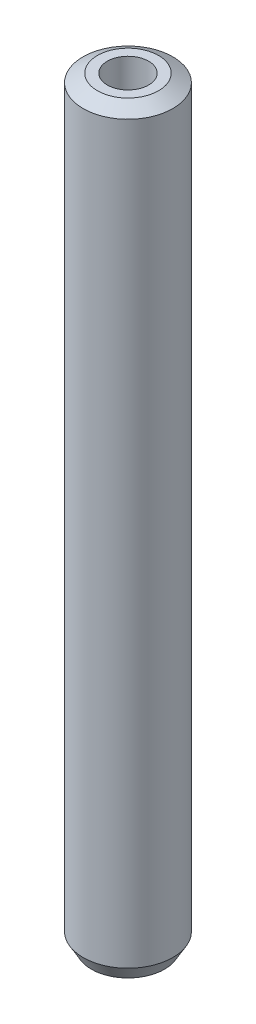
ISO-10303-21;
HEADER;
FILE_DESCRIPTION(('STEP AP214'),'2;1');
FILE_NAME('part.step','',(''),(''),'','','');
FILE_SCHEMA(('AUTOMOTIVE_DESIGN { 1 0 10303 214 1 1 1 1 }'));
ENDSEC;
DATA;
#1=APPLICATION_CONTEXT('core data for automotive mechanical design processes');
#2=APPLICATION_PROTOCOL_DEFINITION('international standard','automotive_design',2000,#1);
#3=PRODUCT_CONTEXT('',#1,'mechanical');
#4=PRODUCT('Part','Part','',(#3));
#5=PRODUCT_RELATED_PRODUCT_CATEGORY('part','',(#4));
#6=PRODUCT_DEFINITION_FORMATION('','',#4);
#7=PRODUCT_DEFINITION_CONTEXT('part definition',#1,'design');
#8=PRODUCT_DEFINITION('design','',#6,#7);
#9=PRODUCT_DEFINITION_SHAPE('','',#8);
#10=(LENGTH_UNIT() NAMED_UNIT(*) SI_UNIT(.MILLI.,.METRE.));
#11=(NAMED_UNIT(*) PLANE_ANGLE_UNIT() SI_UNIT($,.RADIAN.));
#12=(NAMED_UNIT(*) SI_UNIT($,.STERADIAN.) SOLID_ANGLE_UNIT());
#13=UNCERTAINTY_MEASURE_WITH_UNIT(LENGTH_MEASURE(1.E-05),#10,'distance_accuracy_value','');
#14=(GEOMETRIC_REPRESENTATION_CONTEXT(3) GLOBAL_UNCERTAINTY_ASSIGNED_CONTEXT((#13)) GLOBAL_UNIT_ASSIGNED_CONTEXT((#10,
#11,#12)) REPRESENTATION_CONTEXT('',''));
#15=CARTESIAN_POINT('',(0.,0.,0.));
#16=DIRECTION('',(0.,0.,1.));
#17=DIRECTION('',(1.,0.,0.));
#18=AXIS2_PLACEMENT_3D('',#15,#16,#17);
#19=CARTESIAN_POINT('',(0.,422.061469823359,0.));
#20=DIRECTION('',(0.,-1.,0.));
#21=DIRECTION('',(0.,0.,-1.));
#22=AXIS2_PLACEMENT_3D('',#19,#20,#21);
#23=CYLINDRICAL_SURFACE('',#22,25.);
#24=CARTESIAN_POINT('',(0.,417.462703302529,0.));
#25=DIRECTION('',(0.,1.,0.));
#26=DIRECTION('',(0.,0.,1.));
#27=AXIS2_PLACEMENT_3D('',#24,#25,#26);
#28=CIRCLE('',#27,25.);
#29=CARTESIAN_POINT('',(0.,417.462703302529,25.));
#30=VERTEX_POINT('',#29);
#31=EDGE_CURVE('E50',#30,#30,#28,.F.);
#32=ORIENTED_EDGE('',*,*,#31,.T.);
#33=EDGE_LOOP('',(#32));
#34=FACE_BOUND('',#33,.T.);
#35=CARTESIAN_POINT('',(0.,7.96529726622425,0.));
#36=DIRECTION('',(0.,1.,0.));
#37=DIRECTION('',(0.,0.,1.));
#38=AXIS2_PLACEMENT_3D('',#35,#36,#37);
#39=CIRCLE('',#38,25.);
#40=CARTESIAN_POINT('',(0.,7.96529726622425,25.));
#41=VERTEX_POINT('',#40);
#42=EDGE_CURVE('E51',#41,#41,#39,.T.);
#43=ORIENTED_EDGE('',*,*,#42,.T.);
#44=EDGE_LOOP('',(#43));
#45=FACE_BOUND('',#44,.T.);
#46=ADVANCED_FACE('F39',(#34,#45),#23,.T.);
#47=CARTESIAN_POINT('',(0.,422.061469823359,0.));
#48=DIRECTION('',(0.,1.,0.));
#49=DIRECTION('',(0.,0.,1.));
#50=AXIS2_PLACEMENT_3D('',#47,#48,#49);
#51=PLANE('',#50);
#52=CARTESIAN_POINT('',(0.,422.061469823359,0.));
#53=DIRECTION('',(0.,1.,0.));
#54=DIRECTION('',(0.,0.,1.));
#55=AXIS2_PLACEMENT_3D('',#52,#53,#54);
#56=CIRCLE('',#55,17.0347027337758);
#57=CARTESIAN_POINT('',(0.,422.061469823359,17.0347027337758));
#58=VERTEX_POINT('',#57);
#59=EDGE_CURVE('E54',#58,#58,#56,.T.);
#60=ORIENTED_EDGE('',*,*,#59,.T.);
#61=EDGE_LOOP('',(#60));
#62=FACE_BOUND('',#61,.T.);
#63=CARTESIAN_POINT('',(0.,422.061469823359,0.));
#64=DIRECTION('',(0.,1.,0.));
#65=DIRECTION('',(0.,0.,1.));
#66=AXIS2_PLACEMENT_3D('',#63,#64,#65);
#67=CIRCLE('',#66,11.5132658832677);
#68=CARTESIAN_POINT('',(0.,422.061469823359,11.5132658832677));
#69=VERTEX_POINT('',#68);
#70=EDGE_CURVE('E58',#69,#69,#67,.T.);
#71=ORIENTED_EDGE('',*,*,#70,.F.);
#72=EDGE_LOOP('',(#71));
#73=FACE_BOUND('',#72,.T.);
#74=ADVANCED_FACE('F69',(#62,#73),#51,.T.);
#75=CARTESIAN_POINT('',(0.,0.,0.));
#76=DIRECTION('',(0.,1.,0.));
#77=DIRECTION('',(0.,0.,1.));
#78=AXIS2_PLACEMENT_3D('',#75,#76,#77);
#79=PLANE('',#78);
#80=CARTESIAN_POINT('',(0.,0.,0.));
#81=DIRECTION('',(0.,1.,0.));
#82=DIRECTION('',(0.,0.,1.));
#83=AXIS2_PLACEMENT_3D('',#80,#81,#82);
#84=CIRCLE('',#83,20.40123347917);
#85=CARTESIAN_POINT('',(0.,0.,20.40123347917));
#86=VERTEX_POINT('',#85);
#87=EDGE_CURVE('E10',#86,#86,#84,.F.);
#88=ORIENTED_EDGE('',*,*,#87,.T.);
#89=EDGE_LOOP('',(#88));
#90=FACE_BOUND('',#89,.T.);
#91=CARTESIAN_POINT('',(0.,0.,0.));
#92=DIRECTION('',(0.,1.,0.));
#93=DIRECTION('',(0.,0.,1.));
#94=AXIS2_PLACEMENT_3D('',#91,#92,#93);
#95=CIRCLE('',#94,11.5132658832677);
#96=CARTESIAN_POINT('',(0.,0.,11.5132658832677));
#97=VERTEX_POINT('',#96);
#98=EDGE_CURVE('E63',#97,#97,#95,.T.);
#99=ORIENTED_EDGE('',*,*,#98,.T.);
#100=EDGE_LOOP('',(#99));
#101=FACE_BOUND('',#100,.T.);
#102=ADVANCED_FACE('F75',(#90,#101),#79,.F.);
#103=CARTESIAN_POINT('',(0.,422.061469823359,0.));
#104=DIRECTION('',(0.,-1.,0.));
#105=DIRECTION('',(0.,0.,-1.));
#106=AXIS2_PLACEMENT_3D('',#103,#104,#105);
#107=CYLINDRICAL_SURFACE('',#106,11.5132658832677);
#108=ORIENTED_EDGE('',*,*,#70,.T.);
#109=EDGE_LOOP('',(#108));
#110=FACE_BOUND('',#109,.T.);
#111=ORIENTED_EDGE('',*,*,#98,.F.);
#112=EDGE_LOOP('',(#111));
#113=FACE_BOUND('',#112,.T.);
#114=ADVANCED_FACE('F70',(#110,#113),#107,.F.);
#115=CARTESIAN_POINT('',(0.,422.061469823359,0.));
#116=DIRECTION('',(0.,-1.,0.));
#117=DIRECTION('',(0.,0.,-1.));
#118=AXIS2_PLACEMENT_3D('',#115,#116,#117);
#119=CONICAL_SURFACE('',#118,17.0347027337758,1.0471975511966);
#120=ORIENTED_EDGE('',*,*,#31,.F.);
#121=EDGE_LOOP('',(#120));
#122=FACE_BOUND('',#121,.T.);
#123=ORIENTED_EDGE('',*,*,#59,.F.);
#124=EDGE_LOOP('',(#123));
#125=FACE_BOUND('',#124,.T.);
#126=ADVANCED_FACE('F81',(#122,#125),#119,.T.);
#127=CARTESIAN_POINT('',(0.,7.96529726622425,0.));
#128=DIRECTION('',(0.,1.,0.));
#129=DIRECTION('',(0.,0.,1.));
#130=AXIS2_PLACEMENT_3D('',#127,#128,#129);
#131=CONICAL_SURFACE('',#130,25.,0.5235987755983);
#132=ORIENTED_EDGE('',*,*,#87,.F.);
#133=EDGE_LOOP('',(#132));
#134=FACE_BOUND('',#133,.T.);
#135=ORIENTED_EDGE('',*,*,#42,.F.);
#136=EDGE_LOOP('',(#135));
#137=FACE_BOUND('',#136,.T.);
#138=ADVANCED_FACE('F45',(#134,#137),#131,.T.);
#139=CLOSED_SHELL('',(#46,#74,#102,#114,#126,#138));
#140=MANIFOLD_SOLID_BREP('B2',#139);
#141=ADVANCED_BREP_SHAPE_REPRESENTATION('',(#18,#140),#14);
#142=SHAPE_DEFINITION_REPRESENTATION(#9,#141);
ENDSEC;
END-ISO-10303-21;
